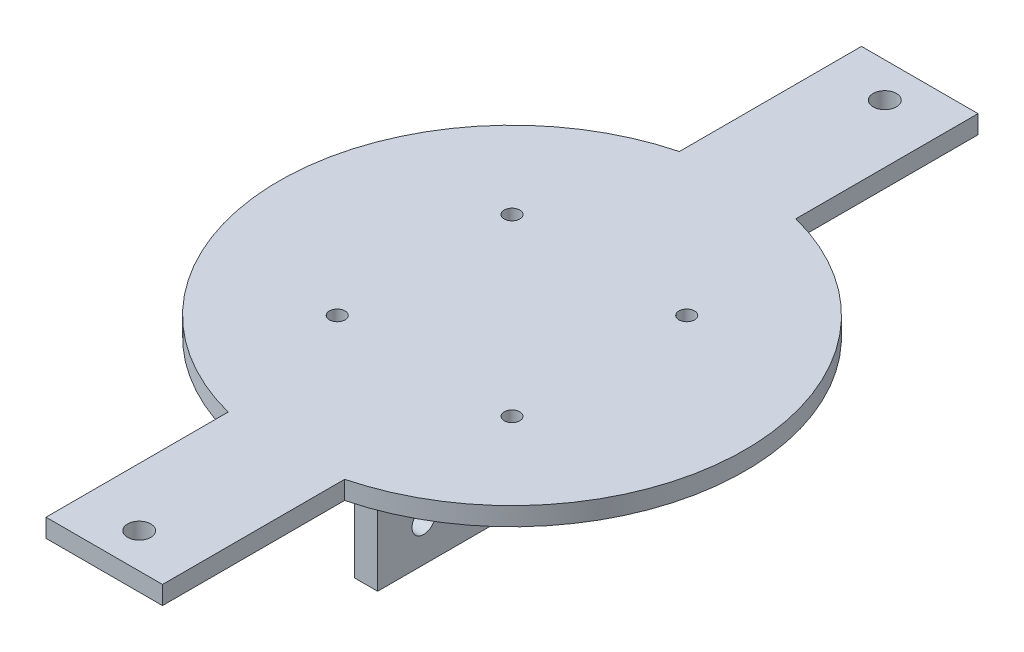
ISO-10303-21;
HEADER;
FILE_DESCRIPTION(('STEP AP214'),'2;1');
FILE_NAME('part.step','',(''),(''),'','','');
FILE_SCHEMA(('AUTOMOTIVE_DESIGN { 1 0 10303 214 1 1 1 1 }'));
ENDSEC;
DATA;
#1=APPLICATION_CONTEXT('core data for automotive mechanical design processes');
#2=APPLICATION_PROTOCOL_DEFINITION('international standard','automotive_design',2000,#1);
#3=PRODUCT_CONTEXT('',#1,'mechanical');
#4=PRODUCT('Part','Part','',(#3));
#5=PRODUCT_RELATED_PRODUCT_CATEGORY('part','',(#4));
#6=PRODUCT_DEFINITION_FORMATION('','',#4);
#7=PRODUCT_DEFINITION_CONTEXT('part definition',#1,'design');
#8=PRODUCT_DEFINITION('design','',#6,#7);
#9=PRODUCT_DEFINITION_SHAPE('','',#8);
#10=(LENGTH_UNIT() NAMED_UNIT(*) SI_UNIT(.MILLI.,.METRE.));
#11=(NAMED_UNIT(*) PLANE_ANGLE_UNIT() SI_UNIT($,.RADIAN.));
#12=(NAMED_UNIT(*) SI_UNIT($,.STERADIAN.) SOLID_ANGLE_UNIT());
#13=UNCERTAINTY_MEASURE_WITH_UNIT(LENGTH_MEASURE(1.E-05),#10,'distance_accuracy_value','');
#14=(GEOMETRIC_REPRESENTATION_CONTEXT(3) GLOBAL_UNCERTAINTY_ASSIGNED_CONTEXT((#13)) GLOBAL_UNIT_ASSIGNED_CONTEXT((#10,
#11,#12)) REPRESENTATION_CONTEXT('',''));
#15=CARTESIAN_POINT('',(0.,0.,0.));
#16=DIRECTION('',(0.,0.,1.));
#17=DIRECTION('',(1.,0.,0.));
#18=AXIS2_PLACEMENT_3D('',#15,#16,#17);
#19=CARTESIAN_POINT('',(0.,0.,0.));
#20=DIRECTION('',(0.,1.,0.));
#21=DIRECTION('',(0.,0.,1.));
#22=AXIS2_PLACEMENT_3D('',#19,#20,#21);
#23=PLANE('',#22);
#24=CARTESIAN_POINT('',(0.,0.,-81.28));
#25=DIRECTION('',(0.,1.,0.));
#26=DIRECTION('',(0.,0.,1.));
#27=AXIS2_PLACEMENT_3D('',#24,#25,#26);
#28=CIRCLE('',#27,2.54);
#29=CARTESIAN_POINT('',(0.,0.,-78.74));
#30=VERTEX_POINT('',#29);
#31=EDGE_CURVE('E421',#30,#30,#28,.T.);
#32=ORIENTED_EDGE('',*,*,#31,.T.);
#33=EDGE_LOOP('',(#32));
#34=FACE_BOUND('',#33,.T.);
#35=CARTESIAN_POINT('',(0.,0.,81.28));
#36=DIRECTION('',(0.,1.,0.));
#37=DIRECTION('',(0.,0.,1.));
#38=AXIS2_PLACEMENT_3D('',#35,#36,#37);
#39=CIRCLE('',#38,2.53999999999999);
#40=CARTESIAN_POINT('',(0.,0.,83.82));
#41=VERTEX_POINT('',#40);
#42=EDGE_CURVE('E846',#41,#41,#39,.T.);
#43=ORIENTED_EDGE('',*,*,#42,.T.);
#44=EDGE_LOOP('',(#43));
#45=FACE_BOUND('',#44,.T.);
#46=CARTESIAN_POINT('',(19.05,0.,19.05));
#47=DIRECTION('',(0.,1.,0.));
#48=DIRECTION('',(0.,0.,1.));
#49=AXIS2_PLACEMENT_3D('',#46,#47,#48);
#50=CIRCLE('',#49,1.69999999999999);
#51=CARTESIAN_POINT('',(19.05,0.,20.75));
#52=VERTEX_POINT('',#51);
#53=EDGE_CURVE('E439',#52,#52,#50,.T.);
#54=ORIENTED_EDGE('',*,*,#53,.T.);
#55=EDGE_LOOP('',(#54));
#56=FACE_BOUND('',#55,.T.);
#57=CARTESIAN_POINT('',(19.05,0.,-19.05));
#58=DIRECTION('',(0.,1.,0.));
#59=DIRECTION('',(0.,0.,1.));
#60=AXIS2_PLACEMENT_3D('',#57,#58,#59);
#61=CIRCLE('',#60,1.69999999999999);
#62=CARTESIAN_POINT('',(19.05,0.,-17.35));
#63=VERTEX_POINT('',#62);
#64=EDGE_CURVE('E447',#63,#63,#61,.T.);
#65=ORIENTED_EDGE('',*,*,#64,.T.);
#66=EDGE_LOOP('',(#65));
#67=FACE_BOUND('',#66,.T.);
#68=CARTESIAN_POINT('',(-19.05,0.,-19.05));
#69=DIRECTION('',(0.,1.,0.));
#70=DIRECTION('',(0.,0.,1.));
#71=AXIS2_PLACEMENT_3D('',#68,#69,#70);
#72=CIRCLE('',#71,1.69999999999999);
#73=CARTESIAN_POINT('',(-19.05,0.,-17.35));
#74=VERTEX_POINT('',#73);
#75=EDGE_CURVE('E455',#74,#74,#72,.T.);
#76=ORIENTED_EDGE('',*,*,#75,.T.);
#77=EDGE_LOOP('',(#76));
#78=FACE_BOUND('',#77,.T.);
#79=CARTESIAN_POINT('',(-19.05,0.,19.05));
#80=DIRECTION('',(0.,1.,0.));
#81=DIRECTION('',(0.,0.,1.));
#82=AXIS2_PLACEMENT_3D('',#79,#80,#81);
#83=CIRCLE('',#82,1.69999999999999);
#84=CARTESIAN_POINT('',(-19.05,0.,20.75));
#85=VERTEX_POINT('',#84);
#86=EDGE_CURVE('E334',#85,#85,#83,.T.);
#87=ORIENTED_EDGE('',*,*,#86,.T.);
#88=EDGE_LOOP('',(#87));
#89=FACE_BOUND('',#88,.T.);
#90=DIRECTION('',(0.,0.,1.));
#91=VECTOR('',#90,1.);
#92=CARTESIAN_POINT('',(-10.16,0.,-44.45));
#93=LINE('',#92,#91);
#94=CARTESIAN_POINT('',(-10.16,0.,-44.95));
#95=VERTEX_POINT('',#94);
#96=CARTESIAN_POINT('',(-10.16,0.,44.95));
#97=VERTEX_POINT('',#96);
#98=EDGE_CURVE('E218',#95,#97,#93,.T.);
#99=ORIENTED_EDGE('',*,*,#98,.F.);
#100=DIRECTION('',(1.,0.,0.));
#101=VECTOR('',#100,1.);
#102=CARTESIAN_POINT('',(-15.16,0.,-44.95));
#103=LINE('',#102,#101);
#104=CARTESIAN_POINT('',(-15.66,0.,-44.95));
#105=VERTEX_POINT('',#104);
#106=EDGE_CURVE('E348',#95,#105,#103,.F.);
#107=ORIENTED_EDGE('',*,*,#106,.T.);
#108=DIRECTION('',(0.,0.,-1.));
#109=VECTOR('',#108,1.);
#110=CARTESIAN_POINT('',(-15.66,0.,44.45));
#111=LINE('',#110,#109);
#112=CARTESIAN_POINT('',(-15.66,0.,44.95));
#113=VERTEX_POINT('',#112);
#114=EDGE_CURVE('E345',#105,#113,#111,.F.);
#115=ORIENTED_EDGE('',*,*,#114,.T.);
#116=DIRECTION('',(-1.,0.,0.));
#117=VECTOR('',#116,1.);
#118=CARTESIAN_POINT('',(-10.16,0.,44.95));
#119=LINE('',#118,#117);
#120=EDGE_CURVE('E341',#113,#97,#119,.F.);
#121=ORIENTED_EDGE('',*,*,#120,.T.);
#122=EDGE_LOOP('',(#99,#107,#115,#121));
#123=FACE_BOUND('',#122,.T.);
#124=CARTESIAN_POINT('',(0.,0.,0.));
#125=DIRECTION('',(0.,1.,0.));
#126=DIRECTION('',(0.,0.,1.));
#127=AXIS2_PLACEMENT_3D('',#124,#125,#126);
#128=CIRCLE('',#127,50.8);
#129=CARTESIAN_POINT('',(-12.7,0.,-49.1868884968342));
#130=VERTEX_POINT('',#129);
#131=CARTESIAN_POINT('',(-12.7,0.,49.1868884968342));
#132=VERTEX_POINT('',#131);
#133=EDGE_CURVE('E252',#130,#132,#128,.T.);
#134=ORIENTED_EDGE('',*,*,#133,.F.);
#135=DIRECTION('',(0.,0.,1.));
#136=VECTOR('',#135,1.);
#137=CARTESIAN_POINT('',(-12.7,0.,-49.1868884968342));
#138=LINE('',#137,#136);
#139=CARTESIAN_POINT('',(-12.7,0.,-88.9));
#140=VERTEX_POINT('',#139);
#141=EDGE_CURVE('E258',#140,#130,#138,.T.);
#142=ORIENTED_EDGE('',*,*,#141,.F.);
#143=DIRECTION('',(-1.,0.,0.));
#144=VECTOR('',#143,1.);
#145=CARTESIAN_POINT('',(12.7,0.,-88.9));
#146=LINE('',#145,#144);
#147=CARTESIAN_POINT('',(12.7,0.,-88.9));
#148=VERTEX_POINT('',#147);
#149=EDGE_CURVE('E298',#148,#140,#146,.T.);
#150=ORIENTED_EDGE('',*,*,#149,.F.);
#151=DIRECTION('',(0.,0.,-1.));
#152=VECTOR('',#151,1.);
#153=CARTESIAN_POINT('',(12.7,0.,-49.1868884968342));
#154=LINE('',#153,#152);
#155=CARTESIAN_POINT('',(12.7,0.,-49.1868884968342));
#156=VERTEX_POINT('',#155);
#157=EDGE_CURVE('E295',#156,#148,#154,.T.);
#158=ORIENTED_EDGE('',*,*,#157,.F.);
#159=CARTESIAN_POINT('',(0.,0.,0.));
#160=DIRECTION('',(0.,1.,0.));
#161=DIRECTION('',(0.,0.,1.));
#162=AXIS2_PLACEMENT_3D('',#159,#160,#161);
#163=CIRCLE('',#162,50.8);
#164=CARTESIAN_POINT('',(12.7,0.,49.1868884968342));
#165=VERTEX_POINT('',#164);
#166=EDGE_CURVE('E292',#165,#156,#163,.T.);
#167=ORIENTED_EDGE('',*,*,#166,.F.);
#168=DIRECTION('',(0.,0.,-1.));
#169=VECTOR('',#168,1.);
#170=CARTESIAN_POINT('',(12.7,0.,88.9));
#171=LINE('',#170,#169);
#172=CARTESIAN_POINT('',(12.7,0.,88.9));
#173=VERTEX_POINT('',#172);
#174=EDGE_CURVE('E289',#173,#165,#171,.T.);
#175=ORIENTED_EDGE('',*,*,#174,.F.);
#176=DIRECTION('',(1.,0.,0.));
#177=VECTOR('',#176,1.);
#178=CARTESIAN_POINT('',(12.7,0.,88.9));
#179=LINE('',#178,#177);
#180=CARTESIAN_POINT('',(-12.7,0.,88.9));
#181=VERTEX_POINT('',#180);
#182=EDGE_CURVE('E286',#181,#173,#179,.T.);
#183=ORIENTED_EDGE('',*,*,#182,.F.);
#184=DIRECTION('',(0.,0.,1.));
#185=VECTOR('',#184,1.);
#186=CARTESIAN_POINT('',(-12.7,0.,88.9));
#187=LINE('',#186,#185);
#188=EDGE_CURVE('E283',#132,#181,#187,.T.);
#189=ORIENTED_EDGE('',*,*,#188,.F.);
#190=EDGE_LOOP('',(#134,#142,#150,#158,#167,#175,#183,#189));
#191=FACE_BOUND('',#190,.T.);
#192=DIRECTION('',(0.,0.,-1.));
#193=VECTOR('',#192,1.);
#194=CARTESIAN_POINT('',(10.16,0.,44.45));
#195=LINE('',#194,#193);
#196=CARTESIAN_POINT('',(10.16,0.,44.95));
#197=VERTEX_POINT('',#196);
#198=CARTESIAN_POINT('',(10.16,0.,-44.95));
#199=VERTEX_POINT('',#198);
#200=EDGE_CURVE('E213',#197,#199,#195,.T.);
#201=ORIENTED_EDGE('',*,*,#200,.F.);
#202=DIRECTION('',(-1.,0.,0.));
#203=VECTOR('',#202,1.);
#204=CARTESIAN_POINT('',(15.16,0.,44.95));
#205=LINE('',#204,#203);
#206=CARTESIAN_POINT('',(15.66,0.,44.95));
#207=VERTEX_POINT('',#206);
#208=EDGE_CURVE('E358',#197,#207,#205,.F.);
#209=ORIENTED_EDGE('',*,*,#208,.T.);
#210=DIRECTION('',(0.,0.,1.));
#211=VECTOR('',#210,1.);
#212=CARTESIAN_POINT('',(15.66,0.,-44.45));
#213=LINE('',#212,#211);
#214=CARTESIAN_POINT('',(15.66,0.,-44.95));
#215=VERTEX_POINT('',#214);
#216=EDGE_CURVE('E355',#207,#215,#213,.F.);
#217=ORIENTED_EDGE('',*,*,#216,.T.);
#218=DIRECTION('',(1.,0.,0.));
#219=VECTOR('',#218,1.);
#220=CARTESIAN_POINT('',(10.16,0.,-44.95));
#221=LINE('',#220,#219);
#222=EDGE_CURVE('E351',#215,#199,#221,.F.);
#223=ORIENTED_EDGE('',*,*,#222,.T.);
#224=EDGE_LOOP('',(#201,#209,#217,#223));
#225=FACE_BOUND('',#224,.T.);
#226=ADVANCED_FACE('F45',(#34,#45,#56,#67,#78,#89,#123,#191,#225),#23,.F.);
#227=CARTESIAN_POINT('',(0.,4.,0.));
#228=DIRECTION('',(0.,-1.,0.));
#229=DIRECTION('',(0.,0.,-1.));
#230=AXIS2_PLACEMENT_3D('',#227,#228,#229);
#231=CYLINDRICAL_SURFACE('',#230,50.8);
#232=ORIENTED_EDGE('',*,*,#133,.T.);
#233=DIRECTION('',(0.,-1.,0.));
#234=VECTOR('',#233,1.);
#235=CARTESIAN_POINT('',(-12.7,4.,49.1868884968342));
#236=LINE('',#235,#234);
#237=CARTESIAN_POINT('',(-12.7,4.,49.1868884968342));
#238=VERTEX_POINT('',#237);
#239=EDGE_CURVE('E330',#238,#132,#236,.T.);
#240=ORIENTED_EDGE('',*,*,#239,.F.);
#241=CARTESIAN_POINT('',(0.,4.,0.));
#242=DIRECTION('',(0.,1.,0.));
#243=DIRECTION('',(0.,0.,1.));
#244=AXIS2_PLACEMENT_3D('',#241,#242,#243);
#245=CIRCLE('',#244,50.8);
#246=CARTESIAN_POINT('',(-12.7,4.,-49.1868884968342));
#247=VERTEX_POINT('',#246);
#248=EDGE_CURVE('E253',#247,#238,#245,.T.);
#249=ORIENTED_EDGE('',*,*,#248,.F.);
#250=DIRECTION('',(0.,-1.,0.));
#251=VECTOR('',#250,1.);
#252=CARTESIAN_POINT('',(-12.7,4.,-49.1868884968342));
#253=LINE('',#252,#251);
#254=EDGE_CURVE('E279',#247,#130,#253,.T.);
#255=ORIENTED_EDGE('',*,*,#254,.T.);
#256=EDGE_LOOP('',(#232,#240,#249,#255));
#257=FACE_BOUND('',#256,.T.);
#258=ADVANCED_FACE('F507',(#257),#231,.T.);
#259=CARTESIAN_POINT('',(-12.7,4.,88.9));
#260=DIRECTION('',(1.,0.,0.));
#261=DIRECTION('',(0.,0.,-1.));
#262=AXIS2_PLACEMENT_3D('',#259,#260,#261);
#263=PLANE('',#262);
#264=ORIENTED_EDGE('',*,*,#188,.T.);
#265=DIRECTION('',(0.,-1.,0.));
#266=VECTOR('',#265,1.);
#267=CARTESIAN_POINT('',(-12.7,4.,88.9));
#268=LINE('',#267,#266);
#269=CARTESIAN_POINT('',(-12.7,4.,88.9));
#270=VERTEX_POINT('',#269);
#271=EDGE_CURVE('E326',#270,#181,#268,.T.);
#272=ORIENTED_EDGE('',*,*,#271,.F.);
#273=DIRECTION('',(0.,0.,1.));
#274=VECTOR('',#273,1.);
#275=CARTESIAN_POINT('',(-12.7,4.,88.9));
#276=LINE('',#275,#274);
#277=EDGE_CURVE('E257',#238,#270,#276,.T.);
#278=ORIENTED_EDGE('',*,*,#277,.F.);
#279=ORIENTED_EDGE('',*,*,#239,.T.);
#280=EDGE_LOOP('',(#264,#272,#278,#279));
#281=FACE_BOUND('',#280,.T.);
#282=ADVANCED_FACE('F515',(#281),#263,.F.);
#283=CARTESIAN_POINT('',(12.7,4.,88.9));
#284=DIRECTION('',(0.,0.,-1.));
#285=DIRECTION('',(-1.,0.,0.));
#286=AXIS2_PLACEMENT_3D('',#283,#284,#285);
#287=PLANE('',#286);
#288=ORIENTED_EDGE('',*,*,#182,.T.);
#289=DIRECTION('',(0.,-1.,0.));
#290=VECTOR('',#289,1.);
#291=CARTESIAN_POINT('',(12.7,4.,88.9));
#292=LINE('',#291,#290);
#293=CARTESIAN_POINT('',(12.7,4.,88.9));
#294=VERTEX_POINT('',#293);
#295=EDGE_CURVE('E322',#294,#173,#292,.T.);
#296=ORIENTED_EDGE('',*,*,#295,.F.);
#297=DIRECTION('',(1.,0.,0.));
#298=VECTOR('',#297,1.);
#299=CARTESIAN_POINT('',(12.7,4.,88.9));
#300=LINE('',#299,#298);
#301=EDGE_CURVE('E261',#270,#294,#300,.T.);
#302=ORIENTED_EDGE('',*,*,#301,.F.);
#303=ORIENTED_EDGE('',*,*,#271,.T.);
#304=EDGE_LOOP('',(#288,#296,#302,#303));
#305=FACE_BOUND('',#304,.T.);
#306=ADVANCED_FACE('F543',(#305),#287,.F.);
#307=CARTESIAN_POINT('',(12.7,4.,88.9));
#308=DIRECTION('',(-1.,0.,0.));
#309=DIRECTION('',(0.,0.,1.));
#310=AXIS2_PLACEMENT_3D('',#307,#308,#309);
#311=PLANE('',#310);
#312=ORIENTED_EDGE('',*,*,#174,.T.);
#313=DIRECTION('',(0.,-1.,0.));
#314=VECTOR('',#313,1.);
#315=CARTESIAN_POINT('',(12.7,4.,49.1868884968342));
#316=LINE('',#315,#314);
#317=CARTESIAN_POINT('',(12.7,4.,49.1868884968342));
#318=VERTEX_POINT('',#317);
#319=EDGE_CURVE('E318',#318,#165,#316,.T.);
#320=ORIENTED_EDGE('',*,*,#319,.F.);
#321=DIRECTION('',(0.,0.,-1.));
#322=VECTOR('',#321,1.);
#323=CARTESIAN_POINT('',(12.7,4.,88.9));
#324=LINE('',#323,#322);
#325=EDGE_CURVE('E264',#294,#318,#324,.T.);
#326=ORIENTED_EDGE('',*,*,#325,.F.);
#327=ORIENTED_EDGE('',*,*,#295,.T.);
#328=EDGE_LOOP('',(#312,#320,#326,#327));
#329=FACE_BOUND('',#328,.T.);
#330=ADVANCED_FACE('F539',(#329),#311,.F.);
#331=CARTESIAN_POINT('',(0.,4.,0.));
#332=DIRECTION('',(0.,-1.,0.));
#333=DIRECTION('',(0.,0.,-1.));
#334=AXIS2_PLACEMENT_3D('',#331,#332,#333);
#335=CYLINDRICAL_SURFACE('',#334,50.8);
#336=ORIENTED_EDGE('',*,*,#166,.T.);
#337=DIRECTION('',(0.,-1.,0.));
#338=VECTOR('',#337,1.);
#339=CARTESIAN_POINT('',(12.7,4.,-49.1868884968342));
#340=LINE('',#339,#338);
#341=CARTESIAN_POINT('',(12.7,4.,-49.1868884968342));
#342=VERTEX_POINT('',#341);
#343=EDGE_CURVE('E314',#342,#156,#340,.T.);
#344=ORIENTED_EDGE('',*,*,#343,.F.);
#345=CARTESIAN_POINT('',(0.,4.,0.));
#346=DIRECTION('',(0.,1.,0.));
#347=DIRECTION('',(0.,0.,1.));
#348=AXIS2_PLACEMENT_3D('',#345,#346,#347);
#349=CIRCLE('',#348,50.8);
#350=EDGE_CURVE('E267',#318,#342,#349,.T.);
#351=ORIENTED_EDGE('',*,*,#350,.F.);
#352=ORIENTED_EDGE('',*,*,#319,.T.);
#353=EDGE_LOOP('',(#336,#344,#351,#352));
#354=FACE_BOUND('',#353,.T.);
#355=ADVANCED_FACE('F535',(#354),#335,.T.);
#356=CARTESIAN_POINT('',(12.7,4.,-49.1868884968342));
#357=DIRECTION('',(-1.,0.,0.));
#358=DIRECTION('',(0.,0.,1.));
#359=AXIS2_PLACEMENT_3D('',#356,#357,#358);
#360=PLANE('',#359);
#361=ORIENTED_EDGE('',*,*,#157,.T.);
#362=DIRECTION('',(0.,-1.,0.));
#363=VECTOR('',#362,1.);
#364=CARTESIAN_POINT('',(12.7,4.,-88.9));
#365=LINE('',#364,#363);
#366=CARTESIAN_POINT('',(12.7,4.,-88.9));
#367=VERTEX_POINT('',#366);
#368=EDGE_CURVE('E310',#367,#148,#365,.T.);
#369=ORIENTED_EDGE('',*,*,#368,.F.);
#370=DIRECTION('',(0.,0.,-1.));
#371=VECTOR('',#370,1.);
#372=CARTESIAN_POINT('',(12.7,4.,-49.1868884968342));
#373=LINE('',#372,#371);
#374=EDGE_CURVE('E270',#342,#367,#373,.T.);
#375=ORIENTED_EDGE('',*,*,#374,.F.);
#376=ORIENTED_EDGE('',*,*,#343,.T.);
#377=EDGE_LOOP('',(#361,#369,#375,#376));
#378=FACE_BOUND('',#377,.T.);
#379=ADVANCED_FACE('F531',(#378),#360,.F.);
#380=CARTESIAN_POINT('',(12.7,4.,-88.9));
#381=DIRECTION('',(0.,0.,1.));
#382=DIRECTION('',(1.,0.,0.));
#383=AXIS2_PLACEMENT_3D('',#380,#381,#382);
#384=PLANE('',#383);
#385=ORIENTED_EDGE('',*,*,#149,.T.);
#386=DIRECTION('',(0.,-1.,0.));
#387=VECTOR('',#386,1.);
#388=CARTESIAN_POINT('',(-12.7,4.,-88.9));
#389=LINE('',#388,#387);
#390=CARTESIAN_POINT('',(-12.7,4.,-88.9));
#391=VERTEX_POINT('',#390);
#392=EDGE_CURVE('E306',#391,#140,#389,.T.);
#393=ORIENTED_EDGE('',*,*,#392,.F.);
#394=DIRECTION('',(-1.,0.,0.));
#395=VECTOR('',#394,1.);
#396=CARTESIAN_POINT('',(12.7,4.,-88.9));
#397=LINE('',#396,#395);
#398=EDGE_CURVE('E273',#367,#391,#397,.T.);
#399=ORIENTED_EDGE('',*,*,#398,.F.);
#400=ORIENTED_EDGE('',*,*,#368,.T.);
#401=EDGE_LOOP('',(#385,#393,#399,#400));
#402=FACE_BOUND('',#401,.T.);
#403=ADVANCED_FACE('F527',(#402),#384,.F.);
#404=CARTESIAN_POINT('',(-12.7,4.,-49.1868884968342));
#405=DIRECTION('',(1.,0.,0.));
#406=DIRECTION('',(0.,0.,-1.));
#407=AXIS2_PLACEMENT_3D('',#404,#405,#406);
#408=PLANE('',#407);
#409=ORIENTED_EDGE('',*,*,#141,.T.);
#410=ORIENTED_EDGE('',*,*,#254,.F.);
#411=DIRECTION('',(0.,0.,1.));
#412=VECTOR('',#411,1.);
#413=CARTESIAN_POINT('',(-12.7,4.,-49.1868884968342));
#414=LINE('',#413,#412);
#415=EDGE_CURVE('E276',#391,#247,#414,.T.);
#416=ORIENTED_EDGE('',*,*,#415,.F.);
#417=ORIENTED_EDGE('',*,*,#392,.T.);
#418=EDGE_LOOP('',(#409,#410,#416,#417));
#419=FACE_BOUND('',#418,.T.);
#420=ADVANCED_FACE('F524',(#419),#408,.F.);
#421=CARTESIAN_POINT('',(0.,4.,0.));
#422=DIRECTION('',(0.,1.,0.));
#423=DIRECTION('',(0.,0.,1.));
#424=AXIS2_PLACEMENT_3D('',#421,#422,#423);
#425=PLANE('',#424);
#426=CARTESIAN_POINT('',(0.,4.,-81.28));
#427=DIRECTION('',(0.,1.,0.));
#428=DIRECTION('',(0.,0.,1.));
#429=AXIS2_PLACEMENT_3D('',#426,#427,#428);
#430=CIRCLE('',#429,2.54);
#431=CARTESIAN_POINT('',(0.,4.,-78.74));
#432=VERTEX_POINT('',#431);
#433=EDGE_CURVE('E619',#432,#432,#430,.T.);
#434=ORIENTED_EDGE('',*,*,#433,.F.);
#435=EDGE_LOOP('',(#434));
#436=FACE_BOUND('',#435,.T.);
#437=CARTESIAN_POINT('',(0.,4.,81.28));
#438=DIRECTION('',(0.,1.,0.));
#439=DIRECTION('',(0.,0.,-1.));
#440=AXIS2_PLACEMENT_3D('',#437,#438,#439);
#441=CIRCLE('',#440,2.53999999999999);
#442=CARTESIAN_POINT('',(0.,4.,78.74));
#443=VERTEX_POINT('',#442);
#444=EDGE_CURVE('E623',#443,#443,#441,.T.);
#445=ORIENTED_EDGE('',*,*,#444,.F.);
#446=EDGE_LOOP('',(#445));
#447=FACE_BOUND('',#446,.T.);
#448=CARTESIAN_POINT('',(19.05,4.,19.05));
#449=DIRECTION('',(0.,1.,0.));
#450=DIRECTION('',(0.,0.,1.));
#451=AXIS2_PLACEMENT_3D('',#448,#449,#450);
#452=CIRCLE('',#451,1.7);
#453=CARTESIAN_POINT('',(19.05,4.,20.75));
#454=VERTEX_POINT('',#453);
#455=EDGE_CURVE('E394',#454,#454,#452,.T.);
#456=ORIENTED_EDGE('',*,*,#455,.F.);
#457=EDGE_LOOP('',(#456));
#458=FACE_BOUND('',#457,.T.);
#459=CARTESIAN_POINT('',(19.05,4.,-19.05));
#460=DIRECTION('',(0.,1.,0.));
#461=DIRECTION('',(0.,0.,1.));
#462=AXIS2_PLACEMENT_3D('',#459,#460,#461);
#463=CIRCLE('',#462,1.7);
#464=CARTESIAN_POINT('',(19.05,4.,-17.35));
#465=VERTEX_POINT('',#464);
#466=EDGE_CURVE('E443',#465,#465,#463,.T.);
#467=ORIENTED_EDGE('',*,*,#466,.F.);
#468=EDGE_LOOP('',(#467));
#469=FACE_BOUND('',#468,.T.);
#470=CARTESIAN_POINT('',(-19.05,4.,-19.05));
#471=DIRECTION('',(0.,1.,0.));
#472=DIRECTION('',(0.,0.,1.));
#473=AXIS2_PLACEMENT_3D('',#470,#471,#472);
#474=CIRCLE('',#473,1.7);
#475=CARTESIAN_POINT('',(-19.05,4.,-17.35));
#476=VERTEX_POINT('',#475);
#477=EDGE_CURVE('E451',#476,#476,#474,.T.);
#478=ORIENTED_EDGE('',*,*,#477,.F.);
#479=EDGE_LOOP('',(#478));
#480=FACE_BOUND('',#479,.T.);
#481=CARTESIAN_POINT('',(-19.05,4.,19.05));
#482=DIRECTION('',(0.,1.,0.));
#483=DIRECTION('',(0.,0.,1.));
#484=AXIS2_PLACEMENT_3D('',#481,#482,#483);
#485=CIRCLE('',#484,1.7);
#486=CARTESIAN_POINT('',(-19.05,4.,20.75));
#487=VERTEX_POINT('',#486);
#488=EDGE_CURVE('E338',#487,#487,#485,.T.);
#489=ORIENTED_EDGE('',*,*,#488,.F.);
#490=EDGE_LOOP('',(#489));
#491=FACE_BOUND('',#490,.T.);
#492=ORIENTED_EDGE('',*,*,#248,.T.);
#493=ORIENTED_EDGE('',*,*,#277,.T.);
#494=ORIENTED_EDGE('',*,*,#301,.T.);
#495=ORIENTED_EDGE('',*,*,#325,.T.);
#496=ORIENTED_EDGE('',*,*,#350,.T.);
#497=ORIENTED_EDGE('',*,*,#374,.T.);
#498=ORIENTED_EDGE('',*,*,#398,.T.);
#499=ORIENTED_EDGE('',*,*,#415,.T.);
#500=EDGE_LOOP('',(#492,#493,#494,#495,#496,#497,#498,#499));
#501=FACE_BOUND('',#500,.T.);
#502=ADVANCED_FACE('F522',(#436,#447,#458,#469,#480,#491,#501),#425,.T.);
#503=CARTESIAN_POINT('',(-15.16,-18.288,-44.45));
#504=DIRECTION('',(1.,0.,0.));
#505=DIRECTION('',(0.,0.,-1.));
#506=AXIS2_PLACEMENT_3D('',#503,#504,#505);
#507=PLANE('',#506);
#508=CARTESIAN_POINT('',(-15.16,-10.033,34.417));
#509=DIRECTION('',(-1.,0.,0.));
#510=DIRECTION('',(0.,0.,1.));
#511=AXIS2_PLACEMENT_3D('',#508,#509,#510);
#512=CIRCLE('',#511,2.54);
#513=CARTESIAN_POINT('',(-15.16,-10.033,36.957));
#514=VERTEX_POINT('',#513);
#515=EDGE_CURVE('E406',#514,#514,#512,.T.);
#516=ORIENTED_EDGE('',*,*,#515,.F.);
#517=EDGE_LOOP('',(#516));
#518=FACE_BOUND('',#517,.T.);
#519=CARTESIAN_POINT('',(-15.16,-10.033,-34.417));
#520=DIRECTION('',(-1.,0.,0.));
#521=DIRECTION('',(0.,0.,1.));
#522=AXIS2_PLACEMENT_3D('',#519,#520,#521);
#523=CIRCLE('',#522,2.54);
#524=CARTESIAN_POINT('',(-15.16,-10.033,-31.877));
#525=VERTEX_POINT('',#524);
#526=EDGE_CURVE('E415',#525,#525,#523,.T.);
#527=ORIENTED_EDGE('',*,*,#526,.F.);
#528=EDGE_LOOP('',(#527));
#529=FACE_BOUND('',#528,.T.);
#530=DIRECTION('',(0.,1.,0.));
#531=VECTOR('',#530,1.);
#532=CARTESIAN_POINT('',(-15.16,-18.288,44.45));
#533=LINE('',#532,#531);
#534=CARTESIAN_POINT('',(-15.16,-18.288,44.45));
#535=VERTEX_POINT('',#534);
#536=CARTESIAN_POINT('',(-15.16,-0.5,44.45));
#537=VERTEX_POINT('',#536);
#538=EDGE_CURVE('E236',#535,#537,#533,.T.);
#539=ORIENTED_EDGE('',*,*,#538,.T.);
#540=DIRECTION('',(0.,0.,-1.));
#541=VECTOR('',#540,1.);
#542=CARTESIAN_POINT('',(-15.16,-0.5,-44.45));
#543=LINE('',#542,#541);
#544=CARTESIAN_POINT('',(-15.16,-0.5,-44.45));
#545=VERTEX_POINT('',#544);
#546=EDGE_CURVE('E371',#537,#545,#543,.T.);
#547=ORIENTED_EDGE('',*,*,#546,.T.);
#548=DIRECTION('',(0.,1.,0.));
#549=VECTOR('',#548,1.);
#550=CARTESIAN_POINT('',(-15.16,-18.288,-44.45));
#551=LINE('',#550,#549);
#552=CARTESIAN_POINT('',(-15.16,-18.288,-44.45));
#553=VERTEX_POINT('',#552);
#554=EDGE_CURVE('E248',#553,#545,#551,.T.);
#555=ORIENTED_EDGE('',*,*,#554,.F.);
#556=DIRECTION('',(0.,0.,-1.));
#557=VECTOR('',#556,1.);
#558=CARTESIAN_POINT('',(-15.16,-18.288,-44.45));
#559=LINE('',#558,#557);
#560=EDGE_CURVE('E223',#535,#553,#559,.T.);
#561=ORIENTED_EDGE('',*,*,#560,.F.);
#562=EDGE_LOOP('',(#539,#547,#555,#561));
#563=FACE_BOUND('',#562,.T.);
#564=ADVANCED_FACE('F588',(#518,#529,#563),#507,.F.);
#565=CARTESIAN_POINT('',(-15.16,-18.288,-44.45));
#566=DIRECTION('',(0.,0.,1.));
#567=DIRECTION('',(1.,0.,0.));
#568=AXIS2_PLACEMENT_3D('',#565,#566,#567);
#569=PLANE('',#568);
#570=ORIENTED_EDGE('',*,*,#554,.T.);
#571=DIRECTION('',(1.,0.,0.));
#572=VECTOR('',#571,1.);
#573=CARTESIAN_POINT('',(-10.16,-0.5,-44.45));
#574=LINE('',#573,#572);
#575=CARTESIAN_POINT('',(-10.16,-0.5,-44.45));
#576=VERTEX_POINT('',#575);
#577=EDGE_CURVE('E367',#545,#576,#574,.T.);
#578=ORIENTED_EDGE('',*,*,#577,.T.);
#579=DIRECTION('',(0.,1.,0.));
#580=VECTOR('',#579,1.);
#581=CARTESIAN_POINT('',(-10.16,-18.288,-44.45));
#582=LINE('',#581,#580);
#583=CARTESIAN_POINT('',(-10.16,-18.288,-44.45));
#584=VERTEX_POINT('',#583);
#585=EDGE_CURVE('E244',#584,#576,#582,.T.);
#586=ORIENTED_EDGE('',*,*,#585,.F.);
#587=DIRECTION('',(1.,0.,0.));
#588=VECTOR('',#587,1.);
#589=CARTESIAN_POINT('',(-15.16,-18.288,-44.45));
#590=LINE('',#589,#588);
#591=EDGE_CURVE('E227',#553,#584,#590,.T.);
#592=ORIENTED_EDGE('',*,*,#591,.F.);
#593=EDGE_LOOP('',(#570,#578,#586,#592));
#594=FACE_BOUND('',#593,.T.);
#595=ADVANCED_FACE('F580',(#594),#569,.F.);
#596=CARTESIAN_POINT('',(-10.16,-18.288,-44.45));
#597=DIRECTION('',(-1.,0.,0.));
#598=DIRECTION('',(0.,0.,1.));
#599=AXIS2_PLACEMENT_3D('',#596,#597,#598);
#600=PLANE('',#599);
#601=CARTESIAN_POINT('',(-10.16,-10.033,34.417));
#602=DIRECTION('',(-1.,0.,0.));
#603=DIRECTION('',(0.,0.,1.));
#604=AXIS2_PLACEMENT_3D('',#601,#602,#603);
#605=CIRCLE('',#604,2.54);
#606=CARTESIAN_POINT('',(-10.16,-10.033,36.957));
#607=VERTEX_POINT('',#606);
#608=EDGE_CURVE('E399',#607,#607,#605,.T.);
#609=ORIENTED_EDGE('',*,*,#608,.T.);
#610=EDGE_LOOP('',(#609));
#611=FACE_BOUND('',#610,.T.);
#612=CARTESIAN_POINT('',(-10.16,-10.033,-34.417));
#613=DIRECTION('',(-1.,0.,0.));
#614=DIRECTION('',(0.,0.,1.));
#615=AXIS2_PLACEMENT_3D('',#612,#613,#614);
#616=CIRCLE('',#615,2.54);
#617=CARTESIAN_POINT('',(-10.16,-10.033,-31.877));
#618=VERTEX_POINT('',#617);
#619=EDGE_CURVE('E412',#618,#618,#616,.T.);
#620=ORIENTED_EDGE('',*,*,#619,.T.);
#621=EDGE_LOOP('',(#620));
#622=FACE_BOUND('',#621,.T.);
#623=ORIENTED_EDGE('',*,*,#98,.T.);
#624=CARTESIAN_POINT('',(-10.16,-0.5,44.95));
#625=DIRECTION('',(-1.,0.,0.));
#626=DIRECTION('',(0.,0.,1.));
#627=AXIS2_PLACEMENT_3D('',#624,#625,#626);
#628=CIRCLE('',#627,0.5);
#629=CARTESIAN_POINT('',(-10.16,-0.5,44.45));
#630=VERTEX_POINT('',#629);
#631=EDGE_CURVE('E11',#97,#630,#628,.T.);
#632=ORIENTED_EDGE('',*,*,#631,.T.);
#633=DIRECTION('',(0.,1.,0.));
#634=VECTOR('',#633,1.);
#635=CARTESIAN_POINT('',(-10.16,-18.288,44.45));
#636=LINE('',#635,#634);
#637=CARTESIAN_POINT('',(-10.16,-18.288,44.45));
#638=VERTEX_POINT('',#637);
#639=EDGE_CURVE('E241',#638,#630,#636,.T.);
#640=ORIENTED_EDGE('',*,*,#639,.F.);
#641=DIRECTION('',(0.,0.,1.));
#642=VECTOR('',#641,1.);
#643=CARTESIAN_POINT('',(-10.16,-18.288,-44.45));
#644=LINE('',#643,#642);
#645=EDGE_CURVE('E230',#584,#638,#644,.T.);
#646=ORIENTED_EDGE('',*,*,#645,.F.);
#647=ORIENTED_EDGE('',*,*,#585,.T.);
#648=CARTESIAN_POINT('',(-10.16,-0.5,-44.95));
#649=DIRECTION('',(-1.,0.,0.));
#650=DIRECTION('',(0.,0.,1.));
#651=AXIS2_PLACEMENT_3D('',#648,#649,#650);
#652=CIRCLE('',#651,0.5);
#653=EDGE_CURVE('E55',#576,#95,#652,.T.);
#654=ORIENTED_EDGE('',*,*,#653,.T.);
#655=EDGE_LOOP('',(#623,#632,#640,#646,#647,#654));
#656=FACE_BOUND('',#655,.T.);
#657=ADVANCED_FACE('F583',(#611,#622,#656),#600,.F.);
#658=CARTESIAN_POINT('',(-15.16,-18.288,44.45));
#659=DIRECTION('',(0.,0.,-1.));
#660=DIRECTION('',(-1.,0.,0.));
#661=AXIS2_PLACEMENT_3D('',#658,#659,#660);
#662=PLANE('',#661);
#663=ORIENTED_EDGE('',*,*,#639,.T.);
#664=DIRECTION('',(-1.,0.,0.));
#665=VECTOR('',#664,1.);
#666=CARTESIAN_POINT('',(-15.16,-0.5,44.45));
#667=LINE('',#666,#665);
#668=EDGE_CURVE('E68',#630,#537,#667,.T.);
#669=ORIENTED_EDGE('',*,*,#668,.T.);
#670=ORIENTED_EDGE('',*,*,#538,.F.);
#671=DIRECTION('',(-1.,0.,0.));
#672=VECTOR('',#671,1.);
#673=CARTESIAN_POINT('',(-15.16,-18.288,44.45));
#674=LINE('',#673,#672);
#675=EDGE_CURVE('E233',#638,#535,#674,.T.);
#676=ORIENTED_EDGE('',*,*,#675,.F.);
#677=EDGE_LOOP('',(#663,#669,#670,#676));
#678=FACE_BOUND('',#677,.T.);
#679=ADVANCED_FACE('F589',(#678),#662,.F.);
#680=CARTESIAN_POINT('',(0.,-18.288,0.));
#681=DIRECTION('',(0.,1.,0.));
#682=DIRECTION('',(0.,0.,1.));
#683=AXIS2_PLACEMENT_3D('',#680,#681,#682);
#684=PLANE('',#683);
#685=ORIENTED_EDGE('',*,*,#560,.T.);
#686=ORIENTED_EDGE('',*,*,#591,.T.);
#687=ORIENTED_EDGE('',*,*,#645,.T.);
#688=ORIENTED_EDGE('',*,*,#675,.T.);
#689=EDGE_LOOP('',(#685,#686,#687,#688));
#690=FACE_BOUND('',#689,.T.);
#691=ADVANCED_FACE('F488',(#690),#684,.F.);
#692=CARTESIAN_POINT('',(10.16,-18.288,44.45));
#693=DIRECTION('',(1.,0.,0.));
#694=DIRECTION('',(0.,0.,-1.));
#695=AXIS2_PLACEMENT_3D('',#692,#693,#694);
#696=PLANE('',#695);
#697=CARTESIAN_POINT('',(10.16,-10.033,34.417));
#698=DIRECTION('',(1.,0.,0.));
#699=DIRECTION('',(0.,0.,-1.));
#700=AXIS2_PLACEMENT_3D('',#697,#698,#699);
#701=CIRCLE('',#700,2.54);
#702=CARTESIAN_POINT('',(10.16,-10.033,31.877));
#703=VERTEX_POINT('',#702);
#704=EDGE_CURVE('E429',#703,#703,#701,.T.);
#705=ORIENTED_EDGE('',*,*,#704,.T.);
#706=EDGE_LOOP('',(#705));
#707=FACE_BOUND('',#706,.T.);
#708=CARTESIAN_POINT('',(10.16,-10.033,-34.417));
#709=DIRECTION('',(1.,0.,0.));
#710=DIRECTION('',(0.,0.,-1.));
#711=AXIS2_PLACEMENT_3D('',#708,#709,#710);
#712=CIRCLE('',#711,2.54);
#713=CARTESIAN_POINT('',(10.16,-10.033,-36.957));
#714=VERTEX_POINT('',#713);
#715=EDGE_CURVE('E405',#714,#714,#712,.T.);
#716=ORIENTED_EDGE('',*,*,#715,.T.);
#717=EDGE_LOOP('',(#716));
#718=FACE_BOUND('',#717,.T.);
#719=ORIENTED_EDGE('',*,*,#200,.T.);
#720=CARTESIAN_POINT('',(10.16,-0.5,-44.95));
#721=DIRECTION('',(1.,0.,0.));
#722=DIRECTION('',(0.,0.,-1.));
#723=AXIS2_PLACEMENT_3D('',#720,#721,#722);
#724=CIRCLE('',#723,0.5);
#725=CARTESIAN_POINT('',(10.16,-0.5,-44.45));
#726=VERTEX_POINT('',#725);
#727=EDGE_CURVE('E379',#199,#726,#724,.T.);
#728=ORIENTED_EDGE('',*,*,#727,.T.);
#729=DIRECTION('',(0.,1.,0.));
#730=VECTOR('',#729,1.);
#731=CARTESIAN_POINT('',(10.16,-18.288,-44.45));
#732=LINE('',#731,#730);
#733=CARTESIAN_POINT('',(10.16,-18.288,-44.45));
#734=VERTEX_POINT('',#733);
#735=EDGE_CURVE('E211',#734,#726,#732,.T.);
#736=ORIENTED_EDGE('',*,*,#735,.F.);
#737=DIRECTION('',(0.,0.,-1.));
#738=VECTOR('',#737,1.);
#739=CARTESIAN_POINT('',(10.16,-18.288,44.45));
#740=LINE('',#739,#738);
#741=CARTESIAN_POINT('',(10.16,-18.288,44.45));
#742=VERTEX_POINT('',#741);
#743=EDGE_CURVE('E189',#742,#734,#740,.T.);
#744=ORIENTED_EDGE('',*,*,#743,.F.);
#745=DIRECTION('',(0.,1.,0.));
#746=VECTOR('',#745,1.);
#747=CARTESIAN_POINT('',(10.16,-18.288,44.45));
#748=LINE('',#747,#746);
#749=CARTESIAN_POINT('',(10.16,-0.5,44.45));
#750=VERTEX_POINT('',#749);
#751=EDGE_CURVE('E197',#742,#750,#748,.T.);
#752=ORIENTED_EDGE('',*,*,#751,.T.);
#753=CARTESIAN_POINT('',(10.16,-0.5,44.95));
#754=DIRECTION('',(1.,0.,0.));
#755=DIRECTION('',(0.,0.,-1.));
#756=AXIS2_PLACEMENT_3D('',#753,#754,#755);
#757=CIRCLE('',#756,0.5);
#758=EDGE_CURVE('E376',#750,#197,#757,.T.);
#759=ORIENTED_EDGE('',*,*,#758,.T.);
#760=EDGE_LOOP('',(#719,#728,#736,#744,#752,#759));
#761=FACE_BOUND('',#760,.T.);
#762=ADVANCED_FACE('F209',(#707,#718,#761),#696,.F.);
#763=CARTESIAN_POINT('',(10.16,-18.288,-44.45));
#764=DIRECTION('',(0.,0.,1.));
#765=DIRECTION('',(1.,0.,0.));
#766=AXIS2_PLACEMENT_3D('',#763,#764,#765);
#767=PLANE('',#766);
#768=ORIENTED_EDGE('',*,*,#735,.T.);
#769=DIRECTION('',(1.,0.,0.));
#770=VECTOR('',#769,1.);
#771=CARTESIAN_POINT('',(15.16,-0.5,-44.45));
#772=LINE('',#771,#770);
#773=CARTESIAN_POINT('',(15.16,-0.5,-44.45));
#774=VERTEX_POINT('',#773);
#775=EDGE_CURVE('E364',#726,#774,#772,.T.);
#776=ORIENTED_EDGE('',*,*,#775,.T.);
#777=DIRECTION('',(0.,1.,0.));
#778=VECTOR('',#777,1.);
#779=CARTESIAN_POINT('',(15.16,-18.288,-44.45));
#780=LINE('',#779,#778);
#781=CARTESIAN_POINT('',(15.16,-18.288,-44.45));
#782=VERTEX_POINT('',#781);
#783=EDGE_CURVE('E464',#782,#774,#780,.T.);
#784=ORIENTED_EDGE('',*,*,#783,.F.);
#785=DIRECTION('',(1.,0.,0.));
#786=VECTOR('',#785,1.);
#787=CARTESIAN_POINT('',(10.16,-18.288,-44.45));
#788=LINE('',#787,#786);
#789=EDGE_CURVE('E214',#734,#782,#788,.T.);
#790=ORIENTED_EDGE('',*,*,#789,.F.);
#791=EDGE_LOOP('',(#768,#776,#784,#790));
#792=FACE_BOUND('',#791,.T.);
#793=ADVANCED_FACE('F487',(#792),#767,.F.);
#794=CARTESIAN_POINT('',(15.16,-18.288,44.45));
#795=DIRECTION('',(-1.,0.,0.));
#796=DIRECTION('',(0.,0.,1.));
#797=AXIS2_PLACEMENT_3D('',#794,#795,#796);
#798=PLANE('',#797);
#799=CARTESIAN_POINT('',(15.16,-10.033,34.417));
#800=DIRECTION('',(-1.,0.,0.));
#801=DIRECTION('',(0.,0.,1.));
#802=AXIS2_PLACEMENT_3D('',#799,#800,#801);
#803=CIRCLE('',#802,2.54);
#804=CARTESIAN_POINT('',(15.16,-10.033,36.957));
#805=VERTEX_POINT('',#804);
#806=EDGE_CURVE('E49',#805,#805,#803,.T.);
#807=ORIENTED_EDGE('',*,*,#806,.T.);
#808=EDGE_LOOP('',(#807));
#809=FACE_BOUND('',#808,.T.);
#810=CARTESIAN_POINT('',(15.16,-10.033,-34.417));
#811=DIRECTION('',(-1.,0.,0.));
#812=DIRECTION('',(0.,0.,1.));
#813=AXIS2_PLACEMENT_3D('',#810,#811,#812);
#814=CIRCLE('',#813,2.54);
#815=CARTESIAN_POINT('',(15.16,-10.033,-31.877));
#816=VERTEX_POINT('',#815);
#817=EDGE_CURVE('E402',#816,#816,#814,.T.);
#818=ORIENTED_EDGE('',*,*,#817,.T.);
#819=EDGE_LOOP('',(#818));
#820=FACE_BOUND('',#819,.T.);
#821=ORIENTED_EDGE('',*,*,#783,.T.);
#822=DIRECTION('',(0.,0.,1.));
#823=VECTOR('',#822,1.);
#824=CARTESIAN_POINT('',(15.16,-0.5,44.45));
#825=LINE('',#824,#823);
#826=CARTESIAN_POINT('',(15.16,-0.5,44.45));
#827=VERTEX_POINT('',#826);
#828=EDGE_CURVE('E361',#774,#827,#825,.T.);
#829=ORIENTED_EDGE('',*,*,#828,.T.);
#830=DIRECTION('',(0.,1.,0.));
#831=VECTOR('',#830,1.);
#832=CARTESIAN_POINT('',(15.16,-18.288,44.45));
#833=LINE('',#832,#831);
#834=CARTESIAN_POINT('',(15.16,-18.288,44.45));
#835=VERTEX_POINT('',#834);
#836=EDGE_CURVE('E207',#835,#827,#833,.T.);
#837=ORIENTED_EDGE('',*,*,#836,.F.);
#838=DIRECTION('',(0.,0.,1.));
#839=VECTOR('',#838,1.);
#840=CARTESIAN_POINT('',(15.16,-18.288,44.45));
#841=LINE('',#840,#839);
#842=EDGE_CURVE('E192',#782,#835,#841,.T.);
#843=ORIENTED_EDGE('',*,*,#842,.F.);
#844=EDGE_LOOP('',(#821,#829,#837,#843));
#845=FACE_BOUND('',#844,.T.);
#846=ADVANCED_FACE('F474',(#809,#820,#845),#798,.F.);
#847=CARTESIAN_POINT('',(10.16,-18.288,44.45));
#848=DIRECTION('',(0.,0.,-1.));
#849=DIRECTION('',(-1.,0.,0.));
#850=AXIS2_PLACEMENT_3D('',#847,#848,#849);
#851=PLANE('',#850);
#852=ORIENTED_EDGE('',*,*,#836,.T.);
#853=DIRECTION('',(-1.,0.,0.));
#854=VECTOR('',#853,1.);
#855=CARTESIAN_POINT('',(10.16,-0.5,44.45));
#856=LINE('',#855,#854);
#857=EDGE_CURVE('E203',#827,#750,#856,.T.);
#858=ORIENTED_EDGE('',*,*,#857,.T.);
#859=ORIENTED_EDGE('',*,*,#751,.F.);
#860=DIRECTION('',(-1.,0.,0.));
#861=VECTOR('',#860,1.);
#862=CARTESIAN_POINT('',(10.16,-18.288,44.45));
#863=LINE('',#862,#861);
#864=EDGE_CURVE('E185',#835,#742,#863,.T.);
#865=ORIENTED_EDGE('',*,*,#864,.F.);
#866=EDGE_LOOP('',(#852,#858,#859,#865));
#867=FACE_BOUND('',#866,.T.);
#868=ADVANCED_FACE('F201',(#867),#851,.F.);
#869=CARTESIAN_POINT('',(0.,-18.288,0.));
#870=DIRECTION('',(0.,-1.,0.));
#871=DIRECTION('',(0.,0.,-1.));
#872=AXIS2_PLACEMENT_3D('',#869,#870,#871);
#873=PLANE('',#872);
#874=ORIENTED_EDGE('',*,*,#743,.T.);
#875=ORIENTED_EDGE('',*,*,#789,.T.);
#876=ORIENTED_EDGE('',*,*,#842,.T.);
#877=ORIENTED_EDGE('',*,*,#864,.T.);
#878=EDGE_LOOP('',(#874,#875,#876,#877));
#879=FACE_BOUND('',#878,.T.);
#880=ADVANCED_FACE('F187',(#879),#873,.T.);
#881=CARTESIAN_POINT('',(-19.05,4.,19.05));
#882=DIRECTION('',(0.,1.,0.));
#883=DIRECTION('',(0.,0.,1.));
#884=AXIS2_PLACEMENT_3D('',#881,#882,#883);
#885=CYLINDRICAL_SURFACE('',#884,1.69999999999999);
#886=ORIENTED_EDGE('',*,*,#488,.T.);
#887=EDGE_LOOP('',(#886));
#888=FACE_BOUND('',#887,.T.);
#889=ORIENTED_EDGE('',*,*,#86,.F.);
#890=EDGE_LOOP('',(#889));
#891=FACE_BOUND('',#890,.T.);
#892=ADVANCED_FACE('F673',(#888,#891),#885,.F.);
#893=CARTESIAN_POINT('',(-19.05,4.,-19.05));
#894=DIRECTION('',(0.,1.,0.));
#895=DIRECTION('',(0.,0.,1.));
#896=AXIS2_PLACEMENT_3D('',#893,#894,#895);
#897=CYLINDRICAL_SURFACE('',#896,1.69999999999999);
#898=ORIENTED_EDGE('',*,*,#477,.T.);
#899=EDGE_LOOP('',(#898));
#900=FACE_BOUND('',#899,.T.);
#901=ORIENTED_EDGE('',*,*,#75,.F.);
#902=EDGE_LOOP('',(#901));
#903=FACE_BOUND('',#902,.T.);
#904=ADVANCED_FACE('F677',(#900,#903),#897,.F.);
#905=CARTESIAN_POINT('',(19.05,4.,-19.05));
#906=DIRECTION('',(0.,1.,0.));
#907=DIRECTION('',(0.,0.,1.));
#908=AXIS2_PLACEMENT_3D('',#905,#906,#907);
#909=CYLINDRICAL_SURFACE('',#908,1.69999999999999);
#910=ORIENTED_EDGE('',*,*,#466,.T.);
#911=EDGE_LOOP('',(#910));
#912=FACE_BOUND('',#911,.T.);
#913=ORIENTED_EDGE('',*,*,#64,.F.);
#914=EDGE_LOOP('',(#913));
#915=FACE_BOUND('',#914,.T.);
#916=ADVANCED_FACE('F683',(#912,#915),#909,.F.);
#917=CARTESIAN_POINT('',(19.05,4.,19.05));
#918=DIRECTION('',(0.,1.,0.));
#919=DIRECTION('',(0.,0.,1.));
#920=AXIS2_PLACEMENT_3D('',#917,#918,#919);
#921=CYLINDRICAL_SURFACE('',#920,1.69999999999999);
#922=ORIENTED_EDGE('',*,*,#455,.T.);
#923=EDGE_LOOP('',(#922));
#924=FACE_BOUND('',#923,.T.);
#925=ORIENTED_EDGE('',*,*,#53,.F.);
#926=EDGE_LOOP('',(#925));
#927=FACE_BOUND('',#926,.T.);
#928=ADVANCED_FACE('F561',(#924,#927),#921,.F.);
#929=CARTESIAN_POINT('',(10.16,-0.5,-44.95));
#930=DIRECTION('',(-1.,0.,0.));
#931=DIRECTION('',(0.,0.,1.));
#932=AXIS2_PLACEMENT_3D('',#929,#930,#931);
#933=CYLINDRICAL_SURFACE('',#932,0.5);
#934=ORIENTED_EDGE('',*,*,#727,.F.);
#935=ORIENTED_EDGE('',*,*,#222,.F.);
#936=CARTESIAN_POINT('',(15.66,-0.5,-44.95));
#937=DIRECTION('',(-0.707106781186547,0.,-0.707106781186547));
#938=DIRECTION('',(-0.707106781186547,0.,0.707106781186547));
#939=AXIS2_PLACEMENT_3D('',#936,#937,#938);
#940=ELLIPSE('',#939,0.707106781186547,0.5);
#941=EDGE_CURVE('E389',#774,#215,#940,.T.);
#942=ORIENTED_EDGE('',*,*,#941,.F.);
#943=ORIENTED_EDGE('',*,*,#775,.F.);
#944=EDGE_LOOP('',(#934,#935,#942,#943));
#945=FACE_BOUND('',#944,.T.);
#946=ADVANCED_FACE('F558',(#945),#933,.F.);
#947=CARTESIAN_POINT('',(15.66,-0.5,44.45));
#948=DIRECTION('',(0.,0.,-1.));
#949=DIRECTION('',(-1.,0.,0.));
#950=AXIS2_PLACEMENT_3D('',#947,#948,#949);
#951=CYLINDRICAL_SURFACE('',#950,0.5);
#952=ORIENTED_EDGE('',*,*,#941,.T.);
#953=ORIENTED_EDGE('',*,*,#216,.F.);
#954=CARTESIAN_POINT('',(15.66,-0.5,44.95));
#955=DIRECTION('',(0.707106781186547,0.,-0.707106781186547));
#956=DIRECTION('',(-0.707106781186547,0.,-0.707106781186547));
#957=AXIS2_PLACEMENT_3D('',#954,#955,#956);
#958=ELLIPSE('',#957,0.707106781186547,0.5);
#959=EDGE_CURVE('E385',#827,#207,#958,.T.);
#960=ORIENTED_EDGE('',*,*,#959,.F.);
#961=ORIENTED_EDGE('',*,*,#828,.F.);
#962=EDGE_LOOP('',(#952,#953,#960,#961));
#963=FACE_BOUND('',#962,.T.);
#964=ADVANCED_FACE('F554',(#963),#951,.F.);
#965=CARTESIAN_POINT('',(10.16,-0.5,44.95));
#966=DIRECTION('',(1.,0.,0.));
#967=DIRECTION('',(0.,0.,-1.));
#968=AXIS2_PLACEMENT_3D('',#965,#966,#967);
#969=CYLINDRICAL_SURFACE('',#968,0.5);
#970=ORIENTED_EDGE('',*,*,#959,.T.);
#971=ORIENTED_EDGE('',*,*,#208,.F.);
#972=ORIENTED_EDGE('',*,*,#758,.F.);
#973=ORIENTED_EDGE('',*,*,#857,.F.);
#974=EDGE_LOOP('',(#970,#971,#972,#973));
#975=FACE_BOUND('',#974,.T.);
#976=ADVANCED_FACE('F551',(#975),#969,.F.);
#977=CARTESIAN_POINT('',(-15.16,-0.5,44.95));
#978=DIRECTION('',(1.,0.,0.));
#979=DIRECTION('',(0.,0.,-1.));
#980=AXIS2_PLACEMENT_3D('',#977,#978,#979);
#981=CYLINDRICAL_SURFACE('',#980,0.5);
#982=ORIENTED_EDGE('',*,*,#631,.F.);
#983=ORIENTED_EDGE('',*,*,#120,.F.);
#984=CARTESIAN_POINT('',(-15.66,-0.5,44.95));
#985=DIRECTION('',(0.707106781186548,0.,0.707106781186547));
#986=DIRECTION('',(0.707106781186547,0.,-0.707106781186548));
#987=AXIS2_PLACEMENT_3D('',#984,#985,#986);
#988=ELLIPSE('',#987,0.707106781186548,0.5);
#989=EDGE_CURVE('E390',#537,#113,#988,.T.);
#990=ORIENTED_EDGE('',*,*,#989,.F.);
#991=ORIENTED_EDGE('',*,*,#668,.F.);
#992=EDGE_LOOP('',(#982,#983,#990,#991));
#993=FACE_BOUND('',#992,.T.);
#994=ADVANCED_FACE('F47',(#993),#981,.F.);
#995=CARTESIAN_POINT('',(-15.66,-0.5,-44.45));
#996=DIRECTION('',(0.,0.,1.));
#997=DIRECTION('',(1.,0.,0.));
#998=AXIS2_PLACEMENT_3D('',#995,#996,#997);
#999=CYLINDRICAL_SURFACE('',#998,0.5);
#1000=ORIENTED_EDGE('',*,*,#989,.T.);
#1001=ORIENTED_EDGE('',*,*,#114,.F.);
#1002=CARTESIAN_POINT('',(-15.66,-0.5,-44.95));
#1003=DIRECTION('',(-0.707106781186548,0.,0.707106781186547));
#1004=DIRECTION('',(0.707106781186547,0.,0.707106781186548));
#1005=AXIS2_PLACEMENT_3D('',#1002,#1003,#1004);
#1006=ELLIPSE('',#1005,0.707106781186547,0.5);
#1007=EDGE_CURVE('E395',#545,#105,#1006,.T.);
#1008=ORIENTED_EDGE('',*,*,#1007,.F.);
#1009=ORIENTED_EDGE('',*,*,#546,.F.);
#1010=EDGE_LOOP('',(#1000,#1001,#1008,#1009));
#1011=FACE_BOUND('',#1010,.T.);
#1012=ADVANCED_FACE('F500',(#1011),#999,.F.);
#1013=CARTESIAN_POINT('',(-15.16,-0.5,-44.95));
#1014=DIRECTION('',(-1.,0.,0.));
#1015=DIRECTION('',(0.,0.,1.));
#1016=AXIS2_PLACEMENT_3D('',#1013,#1014,#1015);
#1017=CYLINDRICAL_SURFACE('',#1016,0.5);
#1018=ORIENTED_EDGE('',*,*,#1007,.T.);
#1019=ORIENTED_EDGE('',*,*,#106,.F.);
#1020=ORIENTED_EDGE('',*,*,#653,.F.);
#1021=ORIENTED_EDGE('',*,*,#577,.F.);
#1022=EDGE_LOOP('',(#1018,#1019,#1020,#1021));
#1023=FACE_BOUND('',#1022,.T.);
#1024=ADVANCED_FACE('F493',(#1023),#1017,.F.);
#1025=CARTESIAN_POINT('',(50.8,-10.033,-34.417));
#1026=DIRECTION('',(-1.,0.,0.));
#1027=DIRECTION('',(0.,0.,1.));
#1028=AXIS2_PLACEMENT_3D('',#1025,#1026,#1027);
#1029=CYLINDRICAL_SURFACE('',#1028,2.54);
#1030=ORIENTED_EDGE('',*,*,#817,.F.);
#1031=EDGE_LOOP('',(#1030));
#1032=FACE_BOUND('',#1031,.T.);
#1033=ORIENTED_EDGE('',*,*,#715,.F.);
#1034=EDGE_LOOP('',(#1033));
#1035=FACE_BOUND('',#1034,.T.);
#1036=ADVANCED_FACE('F480',(#1032,#1035),#1029,.F.);
#1037=CARTESIAN_POINT('',(50.8,-10.033,34.417));
#1038=DIRECTION('',(-1.,0.,0.));
#1039=DIRECTION('',(0.,0.,1.));
#1040=AXIS2_PLACEMENT_3D('',#1037,#1038,#1039);
#1041=CYLINDRICAL_SURFACE('',#1040,2.54);
#1042=ORIENTED_EDGE('',*,*,#806,.F.);
#1043=EDGE_LOOP('',(#1042));
#1044=FACE_BOUND('',#1043,.T.);
#1045=ORIENTED_EDGE('',*,*,#704,.F.);
#1046=EDGE_LOOP('',(#1045));
#1047=FACE_BOUND('',#1046,.T.);
#1048=ADVANCED_FACE('F476',(#1044,#1047),#1041,.F.);
#1049=ORIENTED_EDGE('',*,*,#526,.T.);
#1050=EDGE_LOOP('',(#1049));
#1051=FACE_BOUND('',#1050,.T.);
#1052=ORIENTED_EDGE('',*,*,#619,.F.);
#1053=EDGE_LOOP('',(#1052));
#1054=FACE_BOUND('',#1053,.T.);
#1055=ADVANCED_FACE('F479',(#1051,#1054),#1029,.F.);
#1056=ORIENTED_EDGE('',*,*,#515,.T.);
#1057=EDGE_LOOP('',(#1056));
#1058=FACE_BOUND('',#1057,.T.);
#1059=ORIENTED_EDGE('',*,*,#608,.F.);
#1060=EDGE_LOOP('',(#1059));
#1061=FACE_BOUND('',#1060,.T.);
#1062=ADVANCED_FACE('F482',(#1058,#1061),#1041,.F.);
#1063=CARTESIAN_POINT('',(0.,-18.288,81.28));
#1064=DIRECTION('',(0.,1.,0.));
#1065=DIRECTION('',(0.,0.,1.));
#1066=AXIS2_PLACEMENT_3D('',#1063,#1064,#1065);
#1067=CYLINDRICAL_SURFACE('',#1066,2.53999999999999);
#1068=ORIENTED_EDGE('',*,*,#444,.T.);
#1069=EDGE_LOOP('',(#1068));
#1070=FACE_BOUND('',#1069,.T.);
#1071=ORIENTED_EDGE('',*,*,#42,.F.);
#1072=EDGE_LOOP('',(#1071));
#1073=FACE_BOUND('',#1072,.T.);
#1074=ADVANCED_FACE('F823',(#1070,#1073),#1067,.F.);
#1075=CARTESIAN_POINT('',(0.,-18.288,-81.28));
#1076=DIRECTION('',(0.,1.,0.));
#1077=DIRECTION('',(0.,0.,1.));
#1078=AXIS2_PLACEMENT_3D('',#1075,#1076,#1077);
#1079=CYLINDRICAL_SURFACE('',#1078,2.54);
#1080=ORIENTED_EDGE('',*,*,#433,.T.);
#1081=EDGE_LOOP('',(#1080));
#1082=FACE_BOUND('',#1081,.T.);
#1083=ORIENTED_EDGE('',*,*,#31,.F.);
#1084=EDGE_LOOP('',(#1083));
#1085=FACE_BOUND('',#1084,.T.);
#1086=ADVANCED_FACE('F829',(#1082,#1085),#1079,.F.);
#1087=CLOSED_SHELL('',(#226,#258,#282,#306,#330,#355,#379,#403,#420,#502,#564,#595,#657,#679,
#691,#762,#793,#846,#868,#880,#892,#904,#916,#928,#946,#964,#976,#994,#1012,#1024,#1036,#1048,
#1055,#1062,#1074,#1086));
#1088=MANIFOLD_SOLID_BREP('B2',#1087);
#1089=ADVANCED_BREP_SHAPE_REPRESENTATION('',(#18,#1088),#14);
#1090=SHAPE_DEFINITION_REPRESENTATION(#9,#1089);
ENDSEC;
END-ISO-10303-21;
